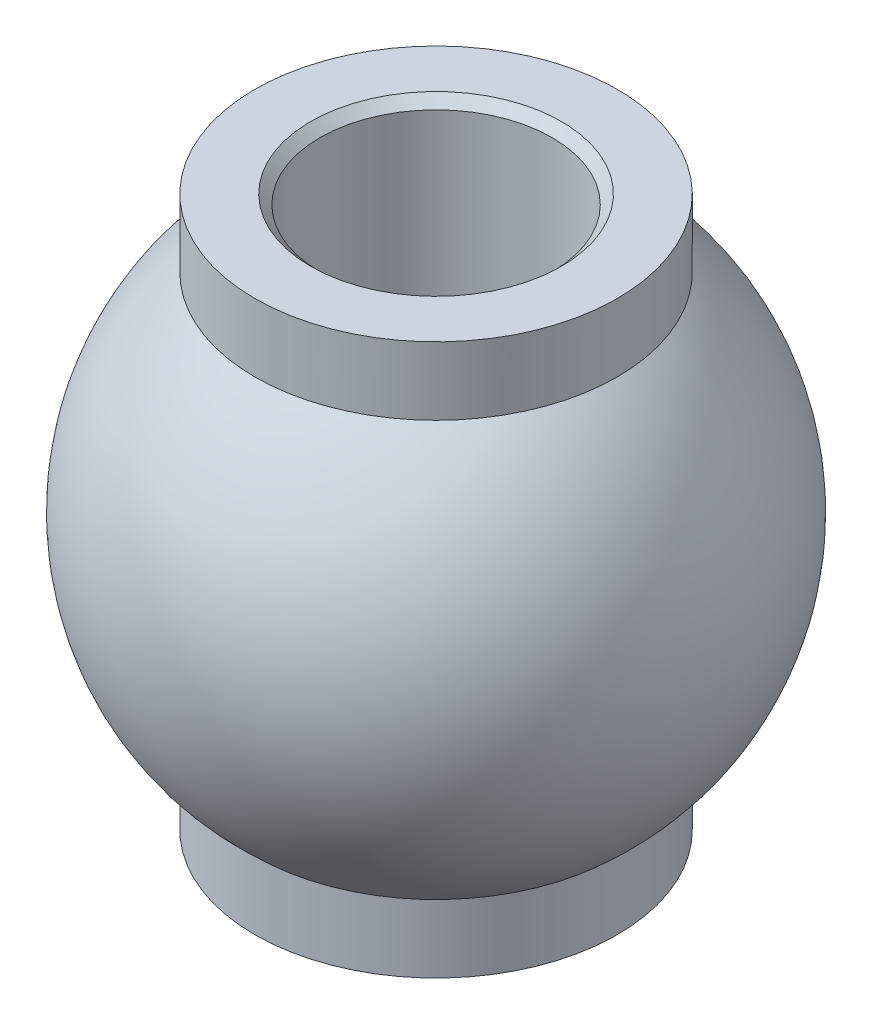
ISO-10303-21;
HEADER;
FILE_DESCRIPTION(('STEP AP214'),'2;1');
FILE_NAME('part.step','',(''),(''),'','','');
FILE_SCHEMA(('AUTOMOTIVE_DESIGN { 1 0 10303 214 1 1 1 1 }'));
ENDSEC;
DATA;
#1=APPLICATION_CONTEXT('core data for automotive mechanical design processes');
#2=APPLICATION_PROTOCOL_DEFINITION('international standard','automotive_design',2000,#1);
#3=PRODUCT_CONTEXT('',#1,'mechanical');
#4=PRODUCT('Part','Part','',(#3));
#5=PRODUCT_RELATED_PRODUCT_CATEGORY('part','',(#4));
#6=PRODUCT_DEFINITION_FORMATION('','',#4);
#7=PRODUCT_DEFINITION_CONTEXT('part definition',#1,'design');
#8=PRODUCT_DEFINITION('design','',#6,#7);
#9=PRODUCT_DEFINITION_SHAPE('','',#8);
#10=(LENGTH_UNIT() NAMED_UNIT(*) SI_UNIT(.MILLI.,.METRE.));
#11=(NAMED_UNIT(*) PLANE_ANGLE_UNIT() SI_UNIT($,.RADIAN.));
#12=(NAMED_UNIT(*) SI_UNIT($,.STERADIAN.) SOLID_ANGLE_UNIT());
#13=UNCERTAINTY_MEASURE_WITH_UNIT(LENGTH_MEASURE(1.E-05),#10,'distance_accuracy_value','');
#14=(GEOMETRIC_REPRESENTATION_CONTEXT(3) GLOBAL_UNCERTAINTY_ASSIGNED_CONTEXT((#13)) GLOBAL_UNIT_ASSIGNED_CONTEXT((#10,
#11,#12)) REPRESENTATION_CONTEXT('',''));
#15=CARTESIAN_POINT('',(0.,0.,0.));
#16=DIRECTION('',(0.,0.,1.));
#17=DIRECTION('',(1.,0.,0.));
#18=AXIS2_PLACEMENT_3D('',#15,#16,#17);
#19=CARTESIAN_POINT('',(0.,0.,49.2252));
#20=DIRECTION('',(0.,1.,0.));
#21=DIRECTION('',(0.,0.,1.));
#22=AXIS2_PLACEMENT_3D('',#19,#20,#21);
#23=CYLINDRICAL_SURFACE('',#22,3.175);
#24=CARTESIAN_POINT('',(0.,7.27710000001025,49.2252));
#25=DIRECTION('',(0.,1.,0.));
#26=DIRECTION('',(0.,0.,-1.));
#27=AXIS2_PLACEMENT_3D('',#24,#25,#26);
#28=CIRCLE('',#27,3.17499999997532);
#29=CARTESIAN_POINT('',(0.,7.27710000001025,46.0502000000247));
#30=VERTEX_POINT('',#29);
#31=EDGE_CURVE('E50',#30,#30,#28,.T.);
#32=ORIENTED_EDGE('',*,*,#31,.T.);
#33=EDGE_LOOP('',(#32));
#34=FACE_BOUND('',#33,.T.);
#35=CARTESIAN_POINT('',(0.,-7.27710000001025,49.2252));
#36=DIRECTION('',(0.,-1.,0.));
#37=DIRECTION('',(0.,0.,-1.));
#38=AXIS2_PLACEMENT_3D('',#35,#36,#37);
#39=CIRCLE('',#38,3.17499999997532);
#40=CARTESIAN_POINT('',(0.,-7.27710000001025,46.0502000000247));
#41=VERTEX_POINT('',#40);
#42=EDGE_CURVE('E53',#41,#41,#39,.T.);
#43=ORIENTED_EDGE('',*,*,#42,.T.);
#44=EDGE_LOOP('',(#43));
#45=FACE_BOUND('',#44,.T.);
#46=ADVANCED_FACE('F16',(#34,#45),#23,.F.);
#47=CARTESIAN_POINT('',(0.,-7.53109999999424,49.2252));
#48=DIRECTION('',(0.,-1.,0.));
#49=DIRECTION('',(1.,0.,0.));
#50=AXIS2_PLACEMENT_3D('',#47,#48,#49);
#51=CONICAL_SURFACE('',#50,3.4289999999593,0.785398163397448);
#52=CARTESIAN_POINT('',(0.,-7.53109999999424,49.2252));
#53=DIRECTION('',(0.,-1.,0.));
#54=DIRECTION('',(1.,0.,0.));
#55=AXIS2_PLACEMENT_3D('',#52,#53,#54);
#56=CIRCLE('',#55,3.4289999999593);
#57=CARTESIAN_POINT('',(3.4289999999593,-7.53109999999424,49.2252));
#58=VERTEX_POINT('',#57);
#59=EDGE_CURVE('E19',#58,#58,#56,.F.);
#60=ORIENTED_EDGE('',*,*,#59,.F.);
#61=EDGE_LOOP('',(#60));
#62=FACE_BOUND('',#61,.T.);
#63=ORIENTED_EDGE('',*,*,#42,.F.);
#64=EDGE_LOOP('',(#63));
#65=FACE_BOUND('',#64,.T.);
#66=ADVANCED_FACE('F71',(#62,#65),#51,.F.);
#67=CARTESIAN_POINT('',(0.,7.53109999999424,49.2252));
#68=DIRECTION('',(0.,1.,0.));
#69=DIRECTION('',(0.,0.,1.));
#70=AXIS2_PLACEMENT_3D('',#67,#68,#69);
#71=CONICAL_SURFACE('',#70,3.4289999999593,0.785398163397448);
#72=CARTESIAN_POINT('',(0.,7.53109999999424,49.2252));
#73=DIRECTION('',(0.,1.,0.));
#74=DIRECTION('',(0.,0.,1.));
#75=AXIS2_PLACEMENT_3D('',#72,#73,#74);
#76=CIRCLE('',#75,3.4289999999593);
#77=CARTESIAN_POINT('',(0.,7.53109999999424,52.6541999999593));
#78=VERTEX_POINT('',#77);
#79=EDGE_CURVE('E62',#78,#78,#76,.F.);
#80=ORIENTED_EDGE('',*,*,#79,.F.);
#81=EDGE_LOOP('',(#80));
#82=FACE_BOUND('',#81,.T.);
#83=ORIENTED_EDGE('',*,*,#31,.F.);
#84=EDGE_LOOP('',(#83));
#85=FACE_BOUND('',#84,.T.);
#86=ADVANCED_FACE('F74',(#82,#85),#71,.F.);
#87=CARTESIAN_POINT('',(0.,-7.5311,49.2252));
#88=DIRECTION('',(0.,-1.,0.));
#89=DIRECTION('',(0.,0.,-1.));
#90=AXIS2_PLACEMENT_3D('',#87,#88,#89);
#91=PLANE('',#90);
#92=CARTESIAN_POINT('',(0.,-7.5311,49.2252));
#93=DIRECTION('',(0.,1.,0.));
#94=DIRECTION('',(0.,0.,1.));
#95=AXIS2_PLACEMENT_3D('',#92,#93,#94);
#96=CIRCLE('',#95,4.953);
#97=CARTESIAN_POINT('',(0.,-7.5311,54.1782));
#98=VERTEX_POINT('',#97);
#99=EDGE_CURVE('E60',#98,#98,#96,.T.);
#100=ORIENTED_EDGE('',*,*,#99,.F.);
#101=EDGE_LOOP('',(#100));
#102=FACE_BOUND('',#101,.T.);
#103=ORIENTED_EDGE('',*,*,#59,.T.);
#104=EDGE_LOOP('',(#103));
#105=FACE_BOUND('',#104,.T.);
#106=ADVANCED_FACE('F69',(#102,#105),#91,.T.);
#107=CARTESIAN_POINT('',(0.,7.5311,49.2252));
#108=DIRECTION('',(0.,1.,0.));
#109=DIRECTION('',(0.,0.,1.));
#110=AXIS2_PLACEMENT_3D('',#107,#108,#109);
#111=PLANE('',#110);
#112=CARTESIAN_POINT('',(0.,7.5311,49.2252));
#113=DIRECTION('',(0.,1.,0.));
#114=DIRECTION('',(0.,0.,1.));
#115=AXIS2_PLACEMENT_3D('',#112,#113,#114);
#116=CIRCLE('',#115,4.953);
#117=CARTESIAN_POINT('',(0.,7.5311,54.1782));
#118=VERTEX_POINT('',#117);
#119=EDGE_CURVE('E57',#118,#118,#116,.F.);
#120=ORIENTED_EDGE('',*,*,#119,.F.);
#121=EDGE_LOOP('',(#120));
#122=FACE_BOUND('',#121,.T.);
#123=ORIENTED_EDGE('',*,*,#79,.T.);
#124=EDGE_LOOP('',(#123));
#125=FACE_BOUND('',#124,.T.);
#126=ADVANCED_FACE('F91',(#122,#125),#111,.T.);
#127=CARTESIAN_POINT('',(0.,0.,49.2252));
#128=DIRECTION('',(0.,1.,0.));
#129=DIRECTION('',(0.,0.,1.));
#130=AXIS2_PLACEMENT_3D('',#127,#128,#129);
#131=CYLINDRICAL_SURFACE('',#130,4.953);
#132=ORIENTED_EDGE('',*,*,#99,.T.);
#133=EDGE_LOOP('',(#132));
#134=FACE_BOUND('',#133,.T.);
#135=CARTESIAN_POINT('',(0.,-5.67320528537439,49.2252));
#136=DIRECTION('',(0.,1.,0.));
#137=DIRECTION('',(0.,0.,1.));
#138=AXIS2_PLACEMENT_3D('',#135,#136,#137);
#139=CIRCLE('',#138,4.953);
#140=CARTESIAN_POINT('',(0.,-5.67320528537439,54.1782));
#141=VERTEX_POINT('',#140);
#142=EDGE_CURVE('E25',#141,#141,#139,.T.);
#143=ORIENTED_EDGE('',*,*,#142,.F.);
#144=EDGE_LOOP('',(#143));
#145=FACE_BOUND('',#144,.T.);
#146=ADVANCED_FACE('F41',(#134,#145),#131,.T.);
#147=CARTESIAN_POINT('',(0.,0.,49.2252));
#148=DIRECTION('',(0.,1.,0.));
#149=DIRECTION('',(0.,0.,1.));
#150=AXIS2_PLACEMENT_3D('',#147,#148,#149);
#151=CYLINDRICAL_SURFACE('',#150,4.953);
#152=CARTESIAN_POINT('',(0.,5.67320528537439,49.2252));
#153=DIRECTION('',(0.,1.,0.));
#154=DIRECTION('',(0.,0.,1.));
#155=AXIS2_PLACEMENT_3D('',#152,#153,#154);
#156=CIRCLE('',#155,4.953);
#157=CARTESIAN_POINT('',(0.,5.67320528537439,54.1782));
#158=VERTEX_POINT('',#157);
#159=EDGE_CURVE('E11',#158,#158,#156,.F.);
#160=ORIENTED_EDGE('',*,*,#159,.F.);
#161=EDGE_LOOP('',(#160));
#162=FACE_BOUND('',#161,.T.);
#163=ORIENTED_EDGE('',*,*,#119,.T.);
#164=EDGE_LOOP('',(#163));
#165=FACE_BOUND('',#164,.T.);
#166=ADVANCED_FACE('F33',(#162,#165),#151,.T.);
#167=CARTESIAN_POINT('',(0.,0.,49.2252));
#168=DIRECTION('',(1.,0.,0.));
#169=DIRECTION('',(0.,1.,0.));
#170=AXIS2_PLACEMENT_3D('',#167,#168,#169);
#171=SPHERICAL_SURFACE('',#170,7.5311);
#172=ORIENTED_EDGE('',*,*,#142,.T.);
#173=EDGE_LOOP('',(#172));
#174=FACE_BOUND('',#173,.T.);
#175=ORIENTED_EDGE('',*,*,#159,.T.);
#176=EDGE_LOOP('',(#175));
#177=FACE_BOUND('',#176,.T.);
#178=CARTESIAN_POINT('',(-7.5311,0.,49.2252));
#179=VERTEX_POINT('',#178);
#180=VERTEX_LOOP('',#179);
#181=FACE_BOUND('',#180,.T.);
#182=CARTESIAN_POINT('',(7.5311,0.,49.2252));
#183=VERTEX_POINT('',#182);
#184=VERTEX_LOOP('',#183);
#185=FACE_BOUND('',#184,.T.);
#186=ADVANCED_FACE('F31',(#174,#177,#181,#185),#171,.T.);
#187=CLOSED_SHELL('',(#46,#66,#86,#106,#126,#146,#166,#186));
#188=MANIFOLD_SOLID_BREP('B1',#187);
#189=ADVANCED_BREP_SHAPE_REPRESENTATION('',(#18,#188),#14);
#190=SHAPE_DEFINITION_REPRESENTATION(#9,#189);
ENDSEC;
END-ISO-10303-21;
